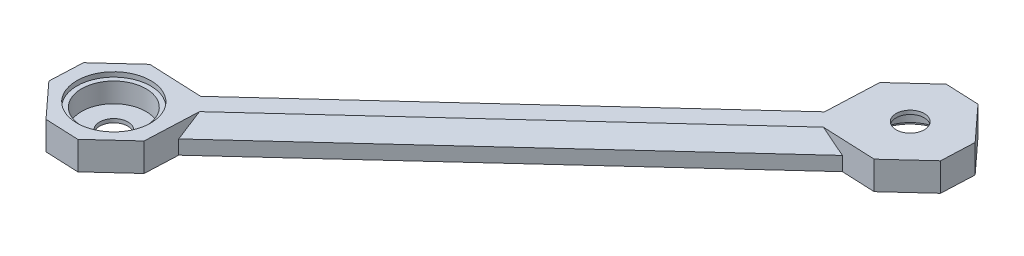
ISO-10303-21;
HEADER;
FILE_DESCRIPTION(('STEP AP214'),'2;1');
FILE_NAME('part.step','',(''),(''),'','','');
FILE_SCHEMA(('AUTOMOTIVE_DESIGN { 1 0 10303 214 1 1 1 1 }'));
ENDSEC;
DATA;
#1=APPLICATION_CONTEXT('core data for automotive mechanical design processes');
#2=APPLICATION_PROTOCOL_DEFINITION('international standard','automotive_design',2000,#1);
#3=PRODUCT_CONTEXT('',#1,'mechanical');
#4=PRODUCT('Part','Part','',(#3));
#5=PRODUCT_RELATED_PRODUCT_CATEGORY('part','',(#4));
#6=PRODUCT_DEFINITION_FORMATION('','',#4);
#7=PRODUCT_DEFINITION_CONTEXT('part definition',#1,'design');
#8=PRODUCT_DEFINITION('design','',#6,#7);
#9=PRODUCT_DEFINITION_SHAPE('','',#8);
#10=(LENGTH_UNIT() NAMED_UNIT(*) SI_UNIT(.MILLI.,.METRE.));
#11=(NAMED_UNIT(*) PLANE_ANGLE_UNIT() SI_UNIT($,.RADIAN.));
#12=(NAMED_UNIT(*) SI_UNIT($,.STERADIAN.) SOLID_ANGLE_UNIT());
#13=UNCERTAINTY_MEASURE_WITH_UNIT(LENGTH_MEASURE(1.E-05),#10,'distance_accuracy_value','');
#14=(GEOMETRIC_REPRESENTATION_CONTEXT(3) GLOBAL_UNCERTAINTY_ASSIGNED_CONTEXT((#13)) GLOBAL_UNIT_ASSIGNED_CONTEXT((#10,
#11,#12)) REPRESENTATION_CONTEXT('',''));
#15=CARTESIAN_POINT('',(0.,0.,0.));
#16=DIRECTION('',(0.,0.,1.));
#17=DIRECTION('',(1.,0.,0.));
#18=AXIS2_PLACEMENT_3D('',#15,#16,#17);
#19=CARTESIAN_POINT('',(64.048276533,-42.300004703,44.965154128));
#20=DIRECTION('',(0.,-1.,0.));
#21=DIRECTION('',(0.207911690937987,0.,-0.97814760070825));
#22=AXIS2_PLACEMENT_3D('',#19,#20,#21);
#23=CYLINDRICAL_SURFACE('',#22,3.);
#24=DIRECTION('',(0.,1.,0.));
#25=VECTOR('',#24,1.);
#26=CARTESIAN_POINT('',(64.672011605,-44.300004703,42.030711326));
#27=LINE('',#26,#25);
#28=CARTESIAN_POINT('',(64.672011605,-44.300004703,42.030711326));
#29=VERTEX_POINT('',#28);
#30=CARTESIAN_POINT('',(64.672011605,-43.500004703,42.030711326));
#31=VERTEX_POINT('',#30);
#32=EDGE_CURVE('E11',#29,#31,#27,.T.);
#33=ORIENTED_EDGE('',*,*,#32,.F.);
#34=CARTESIAN_POINT('',(64.048276533,-44.300004703,44.965154128));
#35=DIRECTION('',(0.,1.,0.));
#36=DIRECTION('',(-0.207911690937987,0.,0.97814760070825));
#37=AXIS2_PLACEMENT_3D('',#34,#35,#36);
#38=CIRCLE('',#37,3.);
#39=CARTESIAN_POINT('',(63.42454146,-44.300004703,47.89959693));
#40=VERTEX_POINT('',#39);
#41=EDGE_CURVE('E56',#40,#29,#38,.T.);
#42=ORIENTED_EDGE('',*,*,#41,.F.);
#43=CARTESIAN_POINT('',(64.048276533,-44.300004703,44.965154128));
#44=DIRECTION('',(0.,1.,0.));
#45=DIRECTION('',(-0.207911690937987,0.,0.97814760070825));
#46=AXIS2_PLACEMENT_3D('',#43,#44,#45);
#47=CIRCLE('',#46,3.);
#48=EDGE_CURVE('E242',#29,#40,#47,.T.);
#49=ORIENTED_EDGE('',*,*,#48,.F.);
#50=ORIENTED_EDGE('',*,*,#32,.T.);
#51=CARTESIAN_POINT('',(64.048276533,-43.500004703,44.965154128));
#52=DIRECTION('',(0.,1.,0.));
#53=DIRECTION('',(-0.207911690937987,0.,0.97814760070825));
#54=AXIS2_PLACEMENT_3D('',#51,#52,#53);
#55=CIRCLE('',#54,3.);
#56=CARTESIAN_POINT('',(63.42454146,-43.500004703,47.89959693));
#57=VERTEX_POINT('',#56);
#58=EDGE_CURVE('E48',#31,#57,#55,.T.);
#59=ORIENTED_EDGE('',*,*,#58,.T.);
#60=CARTESIAN_POINT('',(64.048276533,-43.500004703,44.965154128));
#61=DIRECTION('',(0.,1.,0.));
#62=DIRECTION('',(-0.207911690937987,0.,0.97814760070825));
#63=AXIS2_PLACEMENT_3D('',#60,#61,#62);
#64=CIRCLE('',#63,3.);
#65=EDGE_CURVE('E272',#57,#31,#64,.T.);
#66=ORIENTED_EDGE('',*,*,#65,.T.);
#67=EDGE_LOOP('',(#33,#42,#49,#50,#59,#66));
#68=FACE_BOUND('',#67,.T.);
#69=ADVANCED_FACE('F38',(#68),#23,.F.);
#70=CARTESIAN_POINT('',(348.939297813,-43.500004703,3.286550576));
#71=DIRECTION('',(0.,1.,0.));
#72=DIRECTION('',(1.,0.,0.));
#73=AXIS2_PLACEMENT_3D('',#70,#71,#72);
#74=PLANE('',#73);
#75=ORIENTED_EDGE('',*,*,#58,.F.);
#76=ORIENTED_EDGE('',*,*,#65,.F.);
#77=EDGE_LOOP('',(#75,#76));
#78=FACE_BOUND('',#77,.T.);
#79=DIRECTION('',(-0.043074595994265,0.,0.999071858866984));
#80=VECTOR('',#79,1.);
#81=CARTESIAN_POINT('',(53.603810934,-43.500004703,40.976026611));
#82=LINE('',#81,#80);
#83=CARTESIAN_POINT('',(53.603810934,-43.500004703,40.976026611));
#84=VERTEX_POINT('',#83);
#85=CARTESIAN_POINT('',(53.116477508,-43.500004703,52.279234391));
#86=VERTEX_POINT('',#85);
#87=EDGE_CURVE('E224',#84,#86,#82,.T.);
#88=ORIENTED_EDGE('',*,*,#87,.T.);
#89=DIRECTION('',(-0.736908825306351,0.,0.675992147281027));
#90=VECTOR('',#89,1.);
#91=CARTESIAN_POINT('',(53.116477508,-43.500004703,52.279234391));
#92=LINE('',#91,#90);
#93=CARTESIAN_POINT('',(-16.152952076,-43.500004703,115.82249623));
#94=VERTEX_POINT('',#93);
#95=EDGE_CURVE('E216',#86,#94,#92,.T.);
#96=ORIENTED_EDGE('',*,*,#95,.T.);
#97=DIRECTION('',(-0.999071858866984,0.,-0.043074595994265));
#98=VECTOR('',#97,1.);
#99=CARTESIAN_POINT('',(-16.152952076,-43.500004703,115.82249623));
#100=LINE('',#99,#98);
#101=CARTESIAN_POINT('',(-27.456159857,-43.500004703,115.335162804));
#102=VERTEX_POINT('',#101);
#103=EDGE_CURVE('E207',#94,#102,#100,.T.);
#104=ORIENTED_EDGE('',*,*,#103,.T.);
#105=DIRECTION('',(0.736908825306351,0.,-0.675992147281027));
#106=VECTOR('',#105,1.);
#107=CARTESIAN_POINT('',(-34.82524811,-43.500004703,122.095084277));
#108=LINE('',#107,#106);
#109=CARTESIAN_POINT('',(-34.82524811,-43.500004703,122.095084277));
#110=VERTEX_POINT('',#109);
#111=EDGE_CURVE('E361',#110,#102,#108,.T.);
#112=ORIENTED_EDGE('',*,*,#111,.F.);
#113=DIRECTION('',(-0.0430745959942651,0.,0.999071858866984));
#114=VECTOR('',#113,1.);
#115=CARTESIAN_POINT('',(-34.82524811,-43.500004703,122.095084277));
#116=LINE('',#115,#114);
#117=CARTESIAN_POINT('',(-35.129831501,-43.500004703,129.159589139));
#118=VERTEX_POINT('',#117);
#119=EDGE_CURVE('E217',#110,#118,#116,.T.);
#120=ORIENTED_EDGE('',*,*,#119,.T.);
#121=DIRECTION('',(-0.675992147281027,0.,-0.736908825306351));
#122=VECTOR('',#121,1.);
#123=CARTESIAN_POINT('',(-28.369910029,-43.500004703,136.528677393));
#124=LINE('',#123,#122);
#125=CARTESIAN_POINT('',(-28.369910029,-43.500004703,136.528677393));
#126=VERTEX_POINT('',#125);
#127=EDGE_CURVE('E248',#126,#118,#124,.T.);
#128=ORIENTED_EDGE('',*,*,#127,.F.);
#129=DIRECTION('',(0.999071858866984,0.,0.0430745959942651));
#130=VECTOR('',#129,1.);
#131=CARTESIAN_POINT('',(-28.369910029,-43.500004703,136.528677393));
#132=LINE('',#131,#130);
#133=CARTESIAN_POINT('',(-21.305405166,-43.500004703,136.833260784));
#134=VERTEX_POINT('',#133);
#135=EDGE_CURVE('E342',#126,#134,#132,.T.);
#136=ORIENTED_EDGE('',*,*,#135,.T.);
#137=DIRECTION('',(0.736908825306351,0.,-0.675992147281027));
#138=VECTOR('',#137,1.);
#139=CARTESIAN_POINT('',(-21.305405166,-43.500004703,136.833260784));
#140=LINE('',#139,#138);
#141=CARTESIAN_POINT('',(-13.936316912,-43.500004703,130.073339312));
#142=VERTEX_POINT('',#141);
#143=EDGE_CURVE('E265',#134,#142,#140,.T.);
#144=ORIENTED_EDGE('',*,*,#143,.T.);
#145=DIRECTION('',(-0.043074595994265,0.,0.999071858866984));
#146=VECTOR('',#145,1.);
#147=CARTESIAN_POINT('',(-13.448983487,-43.500004703,118.770131531));
#148=LINE('',#147,#146);
#149=CARTESIAN_POINT('',(-13.448983487,-43.500004703,118.770131531));
#150=VERTEX_POINT('',#149);
#151=EDGE_CURVE('E273',#150,#142,#148,.T.);
#152=ORIENTED_EDGE('',*,*,#151,.F.);
#153=DIRECTION('',(0.736908825306351,0.,-0.675992147281027));
#154=VECTOR('',#153,1.);
#155=CARTESIAN_POINT('',(-13.448983487,-43.500004703,118.770131531));
#156=LINE('',#155,#154);
#157=CARTESIAN_POINT('',(55.820446097,-43.500004703,55.226869693));
#158=VERTEX_POINT('',#157);
#159=EDGE_CURVE('E262',#150,#158,#156,.T.);
#160=ORIENTED_EDGE('',*,*,#159,.T.);
#161=DIRECTION('',(-0.999071858866984,0.,-0.043074595994265));
#162=VECTOR('',#161,1.);
#163=CARTESIAN_POINT('',(67.123653878,-43.500004703,55.714203118));
#164=LINE('',#163,#162);
#165=CARTESIAN_POINT('',(67.123653878,-43.500004703,55.714203118));
#166=VERTEX_POINT('',#165);
#167=EDGE_CURVE('E255',#166,#158,#164,.T.);
#168=ORIENTED_EDGE('',*,*,#167,.F.);
#169=DIRECTION('',(-0.736908825306351,0.,0.675992147281027));
#170=VECTOR('',#169,1.);
#171=CARTESIAN_POINT('',(74.492742132,-43.500004703,48.954281646));
#172=LINE('',#171,#170);
#173=CARTESIAN_POINT('',(74.492742132,-43.500004703,48.954281646));
#174=VERTEX_POINT('',#173);
#175=EDGE_CURVE('E184',#174,#166,#172,.T.);
#176=ORIENTED_EDGE('',*,*,#175,.F.);
#177=DIRECTION('',(-0.0430745959942651,0.,0.999071858866984));
#178=VECTOR('',#177,1.);
#179=CARTESIAN_POINT('',(74.797325522,-43.500004703,41.889776783));
#180=LINE('',#179,#178);
#181=CARTESIAN_POINT('',(74.797325522,-43.500004703,41.889776783));
#182=VERTEX_POINT('',#181);
#183=EDGE_CURVE('E189',#182,#174,#180,.T.);
#184=ORIENTED_EDGE('',*,*,#183,.F.);
#185=DIRECTION('',(0.675992147281027,0.,0.736908825306351));
#186=VECTOR('',#185,1.);
#187=CARTESIAN_POINT('',(68.03740405,-43.500004703,34.520688529));
#188=LINE('',#187,#186);
#189=CARTESIAN_POINT('',(68.03740405,-43.500004703,34.520688529));
#190=VERTEX_POINT('',#189);
#191=EDGE_CURVE('E291',#190,#182,#188,.T.);
#192=ORIENTED_EDGE('',*,*,#191,.F.);
#193=DIRECTION('',(-0.999071858866984,0.,-0.0430745959942651));
#194=VECTOR('',#193,1.);
#195=CARTESIAN_POINT('',(68.03740405,-43.500004703,34.520688529));
#196=LINE('',#195,#194);
#197=CARTESIAN_POINT('',(60.972899187,-43.500004703,34.216105138));
#198=VERTEX_POINT('',#197);
#199=EDGE_CURVE('E266',#190,#198,#196,.T.);
#200=ORIENTED_EDGE('',*,*,#199,.T.);
#201=DIRECTION('',(0.736908825306351,0.,-0.675992147281027));
#202=VECTOR('',#201,1.);
#203=CARTESIAN_POINT('',(53.603810934,-43.500004703,40.976026611));
#204=LINE('',#203,#202);
#205=EDGE_CURVE('E332',#84,#198,#204,.T.);
#206=ORIENTED_EDGE('',*,*,#205,.F.);
#207=EDGE_LOOP('',(#88,#96,#104,#112,#120,#128,#136,#144,#152,#160,#168,#176,#184,#192,#200,#206));
#208=FACE_BOUND('',#207,.T.);
#209=CARTESIAN_POINT('',(-24.380782511,-43.500004703,126.084211794));
#210=DIRECTION('',(0.,1.,0.));
#211=DIRECTION('',(-1.,0.,0.));
#212=AXIS2_PLACEMENT_3D('',#209,#210,#211);
#213=CIRCLE('',#212,7.85);
#214=CARTESIAN_POINT('',(-22.748675738,-43.500004703,118.405753128));
#215=VERTEX_POINT('',#214);
#216=CARTESIAN_POINT('',(-32.230782511,-43.500004703,126.084211794));
#217=VERTEX_POINT('',#216);
#218=EDGE_CURVE('E261',#215,#217,#213,.T.);
#219=ORIENTED_EDGE('',*,*,#218,.F.);
#220=CARTESIAN_POINT('',(-24.380782511,-43.500004703,126.084211794));
#221=DIRECTION('',(0.,1.,0.));
#222=DIRECTION('',(-1.,0.,0.));
#223=AXIS2_PLACEMENT_3D('',#220,#221,#222);
#224=CIRCLE('',#223,7.85);
#225=EDGE_CURVE('E308',#217,#215,#224,.T.);
#226=ORIENTED_EDGE('',*,*,#225,.F.);
#227=EDGE_LOOP('',(#219,#226));
#228=FACE_BOUND('',#227,.T.);
#229=ADVANCED_FACE('F220',(#78,#208,#228),#74,.T.);
#230=CARTESIAN_POINT('',(348.939297813,-44.300004703,3.286550576));
#231=DIRECTION('',(0.,1.,0.));
#232=DIRECTION('',(1.,0.,0.));
#233=AXIS2_PLACEMENT_3D('',#230,#231,#232);
#234=PLANE('',#233);
#235=CARTESIAN_POINT('',(64.048276533,-44.300004703,44.965154128));
#236=DIRECTION('',(0.,1.,0.));
#237=DIRECTION('',(-1.,0.,0.));
#238=AXIS2_PLACEMENT_3D('',#235,#236,#237);
#239=CIRCLE('',#238,6.85);
#240=CARTESIAN_POINT('',(57.198276533,-44.300004703,44.965154128));
#241=VERTEX_POINT('',#240);
#242=EDGE_CURVE('E244',#241,#241,#239,.T.);
#243=ORIENTED_EDGE('',*,*,#242,.F.);
#244=EDGE_LOOP('',(#243));
#245=FACE_BOUND('',#244,.T.);
#246=ORIENTED_EDGE('',*,*,#41,.T.);
#247=ORIENTED_EDGE('',*,*,#48,.T.);
#248=EDGE_LOOP('',(#246,#247));
#249=FACE_BOUND('',#248,.T.);
#250=ADVANCED_FACE('F534',(#245,#249),#234,.F.);
#251=CARTESIAN_POINT('',(64.048276533,-48.500004703,44.965154128));
#252=DIRECTION('',(0.,1.,0.));
#253=DIRECTION('',(-1.,0.,0.));
#254=AXIS2_PLACEMENT_3D('',#251,#252,#253);
#255=CYLINDRICAL_SURFACE('',#254,6.85);
#256=DIRECTION('',(0.,-1.,0.));
#257=VECTOR('',#256,1.);
#258=CARTESIAN_POINT('',(57.198276533,-44.300004703,44.965154128));
#259=LINE('',#258,#257);
#260=CARTESIAN_POINT('',(57.198276533,-48.500004703,44.965154128));
#261=VERTEX_POINT('',#260);
#262=EDGE_CURVE('E288',#241,#261,#259,.T.);
#263=ORIENTED_EDGE('',*,*,#262,.F.);
#264=ORIENTED_EDGE('',*,*,#242,.T.);
#265=ORIENTED_EDGE('',*,*,#262,.T.);
#266=CARTESIAN_POINT('',(64.048276533,-48.500004703,44.965154128));
#267=DIRECTION('',(0.,-1.,0.));
#268=DIRECTION('',(0.,0.,-1.));
#269=AXIS2_PLACEMENT_3D('',#266,#267,#268);
#270=CIRCLE('',#269,6.85);
#271=CARTESIAN_POINT('',(64.048276533,-48.500004703,38.115154128));
#272=VERTEX_POINT('',#271);
#273=EDGE_CURVE('E387',#261,#272,#270,.T.);
#274=ORIENTED_EDGE('',*,*,#273,.T.);
#275=CARTESIAN_POINT('',(64.048276533,-48.500004703,44.965154128));
#276=DIRECTION('',(0.,-1.,0.));
#277=DIRECTION('',(0.,0.,-1.));
#278=AXIS2_PLACEMENT_3D('',#275,#276,#277);
#279=CIRCLE('',#278,6.85);
#280=EDGE_CURVE('E317',#272,#261,#279,.T.);
#281=ORIENTED_EDGE('',*,*,#280,.T.);
#282=EDGE_LOOP('',(#263,#264,#265,#274,#281));
#283=FACE_BOUND('',#282,.T.);
#284=ADVANCED_FACE('F551',(#283),#255,.F.);
#285=CARTESIAN_POINT('',(-35.951723467,-48.500004703,314.965154128));
#286=DIRECTION('',(0.,-1.,0.));
#287=DIRECTION('',(0.,0.,-1.));
#288=AXIS2_PLACEMENT_3D('',#285,#286,#287);
#289=PLANE('',#288);
#290=ORIENTED_EDGE('',*,*,#273,.F.);
#291=ORIENTED_EDGE('',*,*,#280,.F.);
#292=EDGE_LOOP('',(#290,#291));
#293=FACE_BOUND('',#292,.T.);
#294=CARTESIAN_POINT('',(64.048276533,-48.500004703,44.965154128));
#295=DIRECTION('',(0.,1.,0.));
#296=DIRECTION('',(0.,0.,-1.));
#297=AXIS2_PLACEMENT_3D('',#294,#295,#296);
#298=CIRCLE('',#297,7.85);
#299=CARTESIAN_POINT('',(65.680383306,-48.500004703,37.286695462));
#300=VERTEX_POINT('',#299);
#301=CARTESIAN_POINT('',(64.048276533,-48.500004703,37.115154128));
#302=VERTEX_POINT('',#301);
#303=EDGE_CURVE('E281',#300,#302,#298,.T.);
#304=ORIENTED_EDGE('',*,*,#303,.F.);
#305=CARTESIAN_POINT('',(64.048276533,-48.500004703,44.965154128));
#306=DIRECTION('',(0.,1.,0.));
#307=DIRECTION('',(0.,0.,-1.));
#308=AXIS2_PLACEMENT_3D('',#305,#306,#307);
#309=CIRCLE('',#308,7.85);
#310=EDGE_CURVE('E285',#302,#300,#309,.T.);
#311=ORIENTED_EDGE('',*,*,#310,.F.);
#312=EDGE_LOOP('',(#304,#311));
#313=FACE_BOUND('',#312,.T.);
#314=ADVANCED_FACE('F559',(#293,#313),#289,.T.);
#315=CARTESIAN_POINT('',(88.5373879,-43.500004703,25.214478773));
#316=DIRECTION('',(0.477998631020937,0.707106781030973,0.521073228022824));
#317=DIRECTION('',(0.736908825897274,0.,-0.675992146636853));
#318=AXIS2_PLACEMENT_3D('',#315,#316,#317);
#319=PLANE('',#318);
#320=DIRECTION('',(0.0351702609992071,0.577350268986985,-0.815738756981611));
#321=VECTOR('',#320,1.);
#322=CARTESIAN_POINT('',(-13.631733522,-46.500004703,123.008834449));
#323=LINE('',#322,#321);
#324=CARTESIAN_POINT('',(-13.631733522,-46.500004703,123.008834449));
#325=VERTEX_POINT('',#324);
#326=EDGE_CURVE('E274',#325,#150,#323,.T.);
#327=ORIENTED_EDGE('',*,*,#326,.F.);
#328=DIRECTION('',(-0.736908825306351,0.,0.675992147281027));
#329=VECTOR('',#328,1.);
#330=CARTESIAN_POINT('',(60.059149015,-46.500004703,55.409619727));
#331=LINE('',#330,#329);
#332=CARTESIAN_POINT('',(60.059149015,-46.500004703,55.409619727));
#333=VERTEX_POINT('',#332);
#334=EDGE_CURVE('E323',#333,#325,#331,.T.);
#335=ORIENTED_EDGE('',*,*,#334,.F.);
#336=DIRECTION('',(0.815738756981611,-0.577350268986985,0.0351702609992071));
#337=VECTOR('',#336,1.);
#338=CARTESIAN_POINT('',(55.820446097,-43.500004703,55.226869693));
#339=LINE('',#338,#337);
#340=EDGE_CURVE('E252',#158,#333,#339,.T.);
#341=ORIENTED_EDGE('',*,*,#340,.F.);
#342=ORIENTED_EDGE('',*,*,#159,.F.);
#343=EDGE_LOOP('',(#327,#335,#341,#342));
#344=FACE_BOUND('',#343,.T.);
#345=ADVANCED_FACE('F512',(#344),#319,.T.);
#346=CARTESIAN_POINT('',(16.453786275,-46.500004703,81.840138834));
#347=DIRECTION('',(0.477998631020937,-0.707106781030973,0.521073228022824));
#348=DIRECTION('',(-0.828467323191241,-0.560037404468969,0.));
#349=AXIS2_PLACEMENT_3D('',#346,#347,#348);
#350=PLANE('',#349);
#351=DIRECTION('',(-0.815738756981611,-0.577350268986985,-0.0351702609992071));
#352=VECTOR('',#351,1.);
#353=CARTESIAN_POINT('',(-16.152952076,-43.500004703,115.82249623));
#354=LINE('',#353,#352);
#355=CARTESIAN_POINT('',(-20.391654994,-46.500004703,115.639746195));
#356=VERTEX_POINT('',#355);
#357=EDGE_CURVE('E212',#94,#356,#354,.T.);
#358=ORIENTED_EDGE('',*,*,#357,.F.);
#359=ORIENTED_EDGE('',*,*,#95,.F.);
#360=DIRECTION('',(-0.0351702609992071,0.577350268986985,0.815738756981611));
#361=VECTOR('',#360,1.);
#362=CARTESIAN_POINT('',(53.299227543,-46.500004703,48.040531474));
#363=LINE('',#362,#361);
#364=CARTESIAN_POINT('',(53.299227543,-46.500004703,48.040531474));
#365=VERTEX_POINT('',#364);
#366=EDGE_CURVE('E399',#365,#86,#363,.T.);
#367=ORIENTED_EDGE('',*,*,#366,.F.);
#368=DIRECTION('',(0.736908825306351,0.,-0.675992147281027));
#369=VECTOR('',#368,1.);
#370=CARTESIAN_POINT('',(-20.391654994,-46.500004703,115.639746195));
#371=LINE('',#370,#369);
#372=EDGE_CURVE('E232',#356,#365,#371,.T.);
#373=ORIENTED_EDGE('',*,*,#372,.F.);
#374=EDGE_LOOP('',(#358,#359,#367,#373));
#375=FACE_BOUND('',#374,.T.);
#376=ADVANCED_FACE('F230',(#375),#350,.F.);
#377=CARTESIAN_POINT('',(64.048276533,-43.500004703,44.965154128));
#378=DIRECTION('',(0.,-1.,0.));
#379=DIRECTION('',(0.207911690937987,0.,-0.97814760070825));
#380=AXIS2_PLACEMENT_3D('',#377,#378,#379);
#381=CYLINDRICAL_SURFACE('',#380,7.85);
#382=DIRECTION('',(0.,1.,0.));
#383=VECTOR('',#382,1.);
#384=CARTESIAN_POINT('',(65.680383306,-49.500004703,37.286695462));
#385=LINE('',#384,#383);
#386=CARTESIAN_POINT('',(65.680383306,-49.500004703,37.286695462));
#387=VERTEX_POINT('',#386);
#388=EDGE_CURVE('E284',#387,#300,#385,.T.);
#389=ORIENTED_EDGE('',*,*,#388,.F.);
#390=CARTESIAN_POINT('',(64.048276533,-49.500004703,44.965154128));
#391=DIRECTION('',(0.,1.,0.));
#392=DIRECTION('',(-1.,0.,0.));
#393=AXIS2_PLACEMENT_3D('',#390,#391,#392);
#394=CIRCLE('',#393,7.85);
#395=CARTESIAN_POINT('',(56.198276533,-49.500004703,44.965154128));
#396=VERTEX_POINT('',#395);
#397=EDGE_CURVE('E305',#396,#387,#394,.T.);
#398=ORIENTED_EDGE('',*,*,#397,.F.);
#399=CARTESIAN_POINT('',(64.048276533,-49.500004703,44.965154128));
#400=DIRECTION('',(0.,1.,0.));
#401=DIRECTION('',(-1.,0.,0.));
#402=AXIS2_PLACEMENT_3D('',#399,#400,#401);
#403=CIRCLE('',#402,7.85);
#404=EDGE_CURVE('E302',#387,#396,#403,.T.);
#405=ORIENTED_EDGE('',*,*,#404,.F.);
#406=ORIENTED_EDGE('',*,*,#388,.T.);
#407=ORIENTED_EDGE('',*,*,#303,.T.);
#408=ORIENTED_EDGE('',*,*,#310,.T.);
#409=EDGE_LOOP('',(#389,#398,#405,#406,#407,#408));
#410=FACE_BOUND('',#409,.T.);
#411=ADVANCED_FACE('F518',(#410),#381,.F.);
#412=CARTESIAN_POINT('',(-34.977539806,-43.500004703,125.627336708));
#413=DIRECTION('',(0.999071858866984,0.,0.043074595994265));
#414=DIRECTION('',(0.,-1.,0.));
#415=AXIS2_PLACEMENT_3D('',#412,#413,#414);
#416=PLANE('',#415);
#417=DIRECTION('',(-0.0430745959942651,0.,0.999071858866984));
#418=VECTOR('',#417,1.);
#419=CARTESIAN_POINT('',(-34.82524811,-49.500004703,122.095084277));
#420=LINE('',#419,#418);
#421=CARTESIAN_POINT('',(-34.82524811,-49.500004703,122.095084277));
#422=VERTEX_POINT('',#421);
#423=CARTESIAN_POINT('',(-35.129831501,-49.500004703,129.159589139));
#424=VERTEX_POINT('',#423);
#425=EDGE_CURVE('E310',#422,#424,#420,.T.);
#426=ORIENTED_EDGE('',*,*,#425,.T.);
#427=DIRECTION('',(0.,-1.,0.));
#428=VECTOR('',#427,1.);
#429=CARTESIAN_POINT('',(-35.129831501,-43.500004703,129.159589139));
#430=LINE('',#429,#428);
#431=EDGE_CURVE('E251',#118,#424,#430,.T.);
#432=ORIENTED_EDGE('',*,*,#431,.F.);
#433=ORIENTED_EDGE('',*,*,#119,.F.);
#434=DIRECTION('',(0.,-1.,0.));
#435=VECTOR('',#434,1.);
#436=CARTESIAN_POINT('',(-34.82524811,-43.500004703,122.095084277));
#437=LINE('',#436,#435);
#438=EDGE_CURVE('E270',#110,#422,#437,.T.);
#439=ORIENTED_EDGE('',*,*,#438,.T.);
#440=EDGE_LOOP('',(#426,#432,#433,#439));
#441=FACE_BOUND('',#440,.T.);
#442=ADVANCED_FACE('F515',(#441),#416,.F.);
#443=CARTESIAN_POINT('',(-24.380782511,-43.500004703,126.084211794));
#444=DIRECTION('',(0.,-1.,0.));
#445=DIRECTION('',(0.207911690937987,0.,-0.97814760070825));
#446=AXIS2_PLACEMENT_3D('',#443,#444,#445);
#447=CYLINDRICAL_SURFACE('',#446,7.85);
#448=DIRECTION('',(0.,1.,0.));
#449=VECTOR('',#448,1.);
#450=CARTESIAN_POINT('',(-22.748675738,-44.500004703,118.405753128));
#451=LINE('',#450,#449);
#452=CARTESIAN_POINT('',(-22.748675738,-44.500004703,118.405753128));
#453=VERTEX_POINT('',#452);
#454=EDGE_CURVE('E257',#453,#215,#451,.T.);
#455=ORIENTED_EDGE('',*,*,#454,.F.);
#456=CARTESIAN_POINT('',(-24.380782511,-44.500004703,126.084211794));
#457=DIRECTION('',(0.,-1.,0.));
#458=DIRECTION('',(-1.,0.,0.));
#459=AXIS2_PLACEMENT_3D('',#456,#457,#458);
#460=CIRCLE('',#459,7.85);
#461=CARTESIAN_POINT('',(-32.230782511,-44.500004703,126.084211794));
#462=VERTEX_POINT('',#461);
#463=EDGE_CURVE('E267',#453,#462,#460,.T.);
#464=ORIENTED_EDGE('',*,*,#463,.T.);
#465=CARTESIAN_POINT('',(-24.380782511,-44.500004703,126.084211794));
#466=DIRECTION('',(0.,-1.,0.));
#467=DIRECTION('',(-1.,0.,0.));
#468=AXIS2_PLACEMENT_3D('',#465,#466,#467);
#469=CIRCLE('',#468,7.85);
#470=EDGE_CURVE('E260',#462,#453,#469,.T.);
#471=ORIENTED_EDGE('',*,*,#470,.T.);
#472=ORIENTED_EDGE('',*,*,#454,.T.);
#473=ORIENTED_EDGE('',*,*,#218,.T.);
#474=ORIENTED_EDGE('',*,*,#225,.T.);
#475=EDGE_LOOP('',(#455,#464,#471,#472,#473,#474));
#476=FACE_BOUND('',#475,.T.);
#477=ADVANCED_FACE('F517',(#476),#447,.F.);
#478=CARTESIAN_POINT('',(5.135598585,-43.500004703,85.437606944));
#479=DIRECTION('',(-0.675992147281027,0.,-0.736908825306351));
#480=DIRECTION('',(-0.736908825306351,0.,0.675992147281027));
#481=AXIS2_PLACEMENT_3D('',#478,#479,#480);
#482=PLANE('',#481);
#483=DIRECTION('',(0.736908825306351,0.,-0.675992147281027));
#484=VECTOR('',#483,1.);
#485=CARTESIAN_POINT('',(-34.82524811,-49.500004703,122.095084277));
#486=LINE('',#485,#484);
#487=CARTESIAN_POINT('',(-27.456159857,-49.500004703,115.335162804));
#488=VERTEX_POINT('',#487);
#489=EDGE_CURVE('E395',#422,#488,#486,.T.);
#490=ORIENTED_EDGE('',*,*,#489,.F.);
#491=ORIENTED_EDGE('',*,*,#438,.F.);
#492=ORIENTED_EDGE('',*,*,#111,.T.);
#493=DIRECTION('',(0.,-1.,0.));
#494=VECTOR('',#493,1.);
#495=CARTESIAN_POINT('',(-27.456159857,-43.500004703,115.335162804));
#496=LINE('',#495,#494);
#497=EDGE_CURVE('E215',#102,#488,#496,.T.);
#498=ORIENTED_EDGE('',*,*,#497,.T.);
#499=EDGE_LOOP('',(#490,#491,#492,#498));
#500=FACE_BOUND('',#499,.T.);
#501=ADVANCED_FACE('F494',(#500),#482,.T.);
#502=CARTESIAN_POINT('',(-23.923907425,-43.500004703,115.4874545));
#503=DIRECTION('',(-0.043074595994265,0.,0.999071858866984));
#504=DIRECTION('',(0.,1.,0.));
#505=AXIS2_PLACEMENT_3D('',#502,#503,#504);
#506=PLANE('',#505);
#507=DIRECTION('',(-0.999071858866984,0.,-0.0430745959942651));
#508=VECTOR('',#507,1.);
#509=CARTESIAN_POINT('',(-20.391654994,-49.500004703,115.639746195));
#510=LINE('',#509,#508);
#511=CARTESIAN_POINT('',(-20.391654994,-49.500004703,115.639746195));
#512=VERTEX_POINT('',#511);
#513=EDGE_CURVE('E233',#512,#488,#510,.T.);
#514=ORIENTED_EDGE('',*,*,#513,.T.);
#515=ORIENTED_EDGE('',*,*,#497,.F.);
#516=ORIENTED_EDGE('',*,*,#103,.F.);
#517=ORIENTED_EDGE('',*,*,#357,.T.);
#518=DIRECTION('',(0.,-1.,0.));
#519=VECTOR('',#518,1.);
#520=CARTESIAN_POINT('',(-20.391654994,-46.500004703,115.639746195));
#521=LINE('',#520,#519);
#522=EDGE_CURVE('E234',#356,#512,#521,.T.);
#523=ORIENTED_EDGE('',*,*,#522,.T.);
#524=EDGE_LOOP('',(#514,#515,#516,#517,#523));
#525=FACE_BOUND('',#524,.T.);
#526=ADVANCED_FACE('F210',(#525),#506,.F.);
#527=CARTESIAN_POINT('',(16.453786275,-43.500004703,81.840138834));
#528=DIRECTION('',(-0.675992147281027,0.,-0.736908825306351));
#529=DIRECTION('',(-0.736908825306351,0.,0.675992147281027));
#530=AXIS2_PLACEMENT_3D('',#527,#528,#529);
#531=PLANE('',#530);
#532=ORIENTED_EDGE('',*,*,#522,.F.);
#533=ORIENTED_EDGE('',*,*,#372,.T.);
#534=DIRECTION('',(0.,-1.,0.));
#535=VECTOR('',#534,1.);
#536=CARTESIAN_POINT('',(53.299227543,-46.500004703,48.040531474));
#537=LINE('',#536,#535);
#538=CARTESIAN_POINT('',(53.299227543,-49.500004703,48.040531474));
#539=VERTEX_POINT('',#538);
#540=EDGE_CURVE('E327',#365,#539,#537,.T.);
#541=ORIENTED_EDGE('',*,*,#540,.T.);
#542=DIRECTION('',(0.736908825306351,0.,-0.675992147281027));
#543=VECTOR('',#542,1.);
#544=CARTESIAN_POINT('',(-20.391654994,-49.500004703,115.639746195));
#545=LINE('',#544,#543);
#546=EDGE_CURVE('E42',#512,#539,#545,.T.);
#547=ORIENTED_EDGE('',*,*,#546,.F.);
#548=EDGE_LOOP('',(#532,#533,#541,#547));
#549=FACE_BOUND('',#548,.T.);
#550=ADVANCED_FACE('F496',(#549),#531,.T.);
#551=CARTESIAN_POINT('',(53.451519238,-43.500004703,44.508279042));
#552=DIRECTION('',(0.999071858866984,0.,0.043074595994265));
#553=DIRECTION('',(0.,-1.,0.));
#554=AXIS2_PLACEMENT_3D('',#551,#552,#553);
#555=PLANE('',#554);
#556=DIRECTION('',(-0.0430745959942651,0.,0.999071858866984));
#557=VECTOR('',#556,1.);
#558=CARTESIAN_POINT('',(53.603810934,-49.500004703,40.976026611));
#559=LINE('',#558,#557);
#560=CARTESIAN_POINT('',(53.603810934,-49.500004703,40.976026611));
#561=VERTEX_POINT('',#560);
#562=EDGE_CURVE('E330',#561,#539,#559,.T.);
#563=ORIENTED_EDGE('',*,*,#562,.T.);
#564=ORIENTED_EDGE('',*,*,#540,.F.);
#565=ORIENTED_EDGE('',*,*,#366,.T.);
#566=ORIENTED_EDGE('',*,*,#87,.F.);
#567=DIRECTION('',(0.,-1.,0.));
#568=VECTOR('',#567,1.);
#569=CARTESIAN_POINT('',(53.603810934,-43.500004703,40.976026611));
#570=LINE('',#569,#568);
#571=EDGE_CURVE('E335',#84,#561,#570,.T.);
#572=ORIENTED_EDGE('',*,*,#571,.T.);
#573=EDGE_LOOP('',(#563,#564,#565,#566,#572));
#574=FACE_BOUND('',#573,.T.);
#575=ADVANCED_FACE('F436',(#574),#555,.F.);
#576=CARTESIAN_POINT('',(59.130627124,-43.500004703,35.906085507));
#577=DIRECTION('',(-0.675992147281027,0.,-0.736908825306351));
#578=DIRECTION('',(-0.736908825306351,0.,0.675992147281027));
#579=AXIS2_PLACEMENT_3D('',#576,#577,#578);
#580=PLANE('',#579);
#581=DIRECTION('',(0.736908825306351,0.,-0.675992147281027));
#582=VECTOR('',#581,1.);
#583=CARTESIAN_POINT('',(53.603810934,-49.500004703,40.976026611));
#584=LINE('',#583,#582);
#585=CARTESIAN_POINT('',(60.972899187,-49.500004703,34.216105138));
#586=VERTEX_POINT('',#585);
#587=EDGE_CURVE('E372',#561,#586,#584,.T.);
#588=ORIENTED_EDGE('',*,*,#587,.F.);
#589=ORIENTED_EDGE('',*,*,#571,.F.);
#590=ORIENTED_EDGE('',*,*,#205,.T.);
#591=DIRECTION('',(0.,-1.,0.));
#592=VECTOR('',#591,1.);
#593=CARTESIAN_POINT('',(60.972899187,-43.500004703,34.216105138));
#594=LINE('',#593,#592);
#595=EDGE_CURVE('E336',#198,#586,#594,.T.);
#596=ORIENTED_EDGE('',*,*,#595,.T.);
#597=EDGE_LOOP('',(#588,#589,#590,#596));
#598=FACE_BOUND('',#597,.T.);
#599=ADVANCED_FACE('F445',(#598),#580,.T.);
#600=CARTESIAN_POINT('',(64.505151619,-43.500004703,34.368396834));
#601=DIRECTION('',(-0.043074595994265,0.,0.999071858866984));
#602=DIRECTION('',(0.,1.,0.));
#603=AXIS2_PLACEMENT_3D('',#600,#601,#602);
#604=PLANE('',#603);
#605=DIRECTION('',(-0.999071858866984,0.,-0.0430745959942651));
#606=VECTOR('',#605,1.);
#607=CARTESIAN_POINT('',(68.03740405,-49.500004703,34.520688529));
#608=LINE('',#607,#606);
#609=CARTESIAN_POINT('',(68.03740405,-49.500004703,34.520688529));
#610=VERTEX_POINT('',#609);
#611=EDGE_CURVE('E363',#610,#586,#608,.T.);
#612=ORIENTED_EDGE('',*,*,#611,.T.);
#613=ORIENTED_EDGE('',*,*,#595,.F.);
#614=ORIENTED_EDGE('',*,*,#199,.F.);
#615=DIRECTION('',(0.,-1.,0.));
#616=VECTOR('',#615,1.);
#617=CARTESIAN_POINT('',(68.03740405,-43.500004703,34.520688529));
#618=LINE('',#617,#616);
#619=EDGE_CURVE('E293',#190,#610,#618,.T.);
#620=ORIENTED_EDGE('',*,*,#619,.T.);
#621=EDGE_LOOP('',(#612,#613,#614,#620));
#622=FACE_BOUND('',#621,.T.);
#623=ADVANCED_FACE('F450',(#622),#604,.F.);
#624=CARTESIAN_POINT('',(73.107345154,-43.500004703,40.047504719));
#625=DIRECTION('',(0.736908825306351,0.,-0.675992147281027));
#626=DIRECTION('',(0.,-1.,0.));
#627=AXIS2_PLACEMENT_3D('',#624,#625,#626);
#628=PLANE('',#627);
#629=DIRECTION('',(0.675992147281027,0.,0.736908825306351));
#630=VECTOR('',#629,1.);
#631=CARTESIAN_POINT('',(68.03740405,-49.500004703,34.520688529));
#632=LINE('',#631,#630);
#633=CARTESIAN_POINT('',(74.797325522,-49.500004703,41.889776783));
#634=VERTEX_POINT('',#633);
#635=EDGE_CURVE('E371',#610,#634,#632,.T.);
#636=ORIENTED_EDGE('',*,*,#635,.F.);
#637=ORIENTED_EDGE('',*,*,#619,.F.);
#638=ORIENTED_EDGE('',*,*,#191,.T.);
#639=DIRECTION('',(0.,-1.,0.));
#640=VECTOR('',#639,1.);
#641=CARTESIAN_POINT('',(74.797325522,-43.500004703,41.889776783));
#642=LINE('',#641,#640);
#643=EDGE_CURVE('E290',#182,#634,#642,.T.);
#644=ORIENTED_EDGE('',*,*,#643,.T.);
#645=EDGE_LOOP('',(#636,#637,#638,#644));
#646=FACE_BOUND('',#645,.T.);
#647=ADVANCED_FACE('F454',(#646),#628,.T.);
#648=CARTESIAN_POINT('',(74.645033827,-43.500004703,45.422029214));
#649=DIRECTION('',(0.999071858866984,0.,0.043074595994265));
#650=DIRECTION('',(0.,-1.,0.));
#651=AXIS2_PLACEMENT_3D('',#648,#649,#650);
#652=PLANE('',#651);
#653=DIRECTION('',(-0.0430745959942651,0.,0.999071858866984));
#654=VECTOR('',#653,1.);
#655=CARTESIAN_POINT('',(74.797325522,-49.500004703,41.889776783));
#656=LINE('',#655,#654);
#657=CARTESIAN_POINT('',(74.492742132,-49.500004703,48.954281646));
#658=VERTEX_POINT('',#657);
#659=EDGE_CURVE('E240',#634,#658,#656,.T.);
#660=ORIENTED_EDGE('',*,*,#659,.F.);
#661=ORIENTED_EDGE('',*,*,#643,.F.);
#662=ORIENTED_EDGE('',*,*,#183,.T.);
#663=DIRECTION('',(0.,-1.,0.));
#664=VECTOR('',#663,1.);
#665=CARTESIAN_POINT('',(74.492742132,-43.500004703,48.954281646));
#666=LINE('',#665,#664);
#667=EDGE_CURVE('E246',#174,#658,#666,.T.);
#668=ORIENTED_EDGE('',*,*,#667,.T.);
#669=EDGE_LOOP('',(#660,#661,#662,#668));
#670=FACE_BOUND('',#669,.T.);
#671=ADVANCED_FACE('F457',(#670),#652,.T.);
#672=CARTESIAN_POINT('',(68.965925941,-43.500004703,54.02422275));
#673=DIRECTION('',(0.675992147281027,0.,0.736908825306351));
#674=DIRECTION('',(0.,-1.,0.));
#675=AXIS2_PLACEMENT_3D('',#672,#673,#674);
#676=PLANE('',#675);
#677=DIRECTION('',(-0.736908825306351,0.,0.675992147281027));
#678=VECTOR('',#677,1.);
#679=CARTESIAN_POINT('',(74.492742132,-49.500004703,48.954281646));
#680=LINE('',#679,#678);
#681=CARTESIAN_POINT('',(67.123653878,-49.500004703,55.714203118));
#682=VERTEX_POINT('',#681);
#683=EDGE_CURVE('E355',#658,#682,#680,.T.);
#684=ORIENTED_EDGE('',*,*,#683,.F.);
#685=ORIENTED_EDGE('',*,*,#667,.F.);
#686=ORIENTED_EDGE('',*,*,#175,.T.);
#687=DIRECTION('',(0.,-1.,0.));
#688=VECTOR('',#687,1.);
#689=CARTESIAN_POINT('',(67.123653878,-43.500004703,55.714203118));
#690=LINE('',#689,#688);
#691=EDGE_CURVE('E247',#166,#682,#690,.T.);
#692=ORIENTED_EDGE('',*,*,#691,.T.);
#693=EDGE_LOOP('',(#684,#685,#686,#692));
#694=FACE_BOUND('',#693,.T.);
#695=ADVANCED_FACE('F460',(#694),#676,.T.);
#696=CARTESIAN_POINT('',(63.591401446,-43.500004703,55.561911423));
#697=DIRECTION('',(-0.043074595994265,0.,0.999071858866984));
#698=DIRECTION('',(0.,1.,0.));
#699=AXIS2_PLACEMENT_3D('',#696,#697,#698);
#700=PLANE('',#699);
#701=DIRECTION('',(-0.999071858866984,0.,-0.0430745959942651));
#702=VECTOR('',#701,1.);
#703=CARTESIAN_POINT('',(67.123653878,-49.500004703,55.714203118));
#704=LINE('',#703,#702);
#705=CARTESIAN_POINT('',(60.059149015,-49.500004703,55.409619727));
#706=VERTEX_POINT('',#705);
#707=EDGE_CURVE('E354',#682,#706,#704,.T.);
#708=ORIENTED_EDGE('',*,*,#707,.F.);
#709=ORIENTED_EDGE('',*,*,#691,.F.);
#710=ORIENTED_EDGE('',*,*,#167,.T.);
#711=ORIENTED_EDGE('',*,*,#340,.T.);
#712=DIRECTION('',(0.,-1.,0.));
#713=VECTOR('',#712,1.);
#714=CARTESIAN_POINT('',(60.059149015,-46.500004703,55.409619727));
#715=LINE('',#714,#713);
#716=EDGE_CURVE('E256',#333,#706,#715,.T.);
#717=ORIENTED_EDGE('',*,*,#716,.T.);
#718=EDGE_LOOP('',(#708,#709,#710,#711,#717));
#719=FACE_BOUND('',#718,.T.);
#720=ADVANCED_FACE('F464',(#719),#700,.T.);
#721=CARTESIAN_POINT('',(13.915930872,-43.500004703,97.738401848));
#722=DIRECTION('',(-0.675992147281027,0.,-0.736908825306351));
#723=DIRECTION('',(-0.736908825306351,0.,0.675992147281027));
#724=AXIS2_PLACEMENT_3D('',#721,#722,#723);
#725=PLANE('',#724);
#726=ORIENTED_EDGE('',*,*,#716,.F.);
#727=ORIENTED_EDGE('',*,*,#334,.T.);
#728=DIRECTION('',(0.,-1.,0.));
#729=VECTOR('',#728,1.);
#730=CARTESIAN_POINT('',(-13.631733522,-46.500004703,123.008834449));
#731=LINE('',#730,#729);
#732=CARTESIAN_POINT('',(-13.631733522,-49.500004703,123.008834449));
#733=VERTEX_POINT('',#732);
#734=EDGE_CURVE('E325',#325,#733,#731,.T.);
#735=ORIENTED_EDGE('',*,*,#734,.T.);
#736=DIRECTION('',(0.736908825306351,0.,-0.675992147281027));
#737=VECTOR('',#736,1.);
#738=CARTESIAN_POINT('',(-13.631733522,-49.500004703,123.008834449));
#739=LINE('',#738,#737);
#740=EDGE_CURVE('E353',#733,#706,#739,.T.);
#741=ORIENTED_EDGE('',*,*,#740,.T.);
#742=EDGE_LOOP('',(#726,#727,#735,#741));
#743=FACE_BOUND('',#742,.T.);
#744=ADVANCED_FACE('F472',(#743),#725,.F.);
#745=CARTESIAN_POINT('',(-13.784025217,-43.500004703,126.54108688));
#746=DIRECTION('',(0.999071858866984,0.,0.043074595994265));
#747=DIRECTION('',(0.,-1.,0.));
#748=AXIS2_PLACEMENT_3D('',#745,#746,#747);
#749=PLANE('',#748);
#750=DIRECTION('',(-0.0430745959942651,0.,0.999071858866984));
#751=VECTOR('',#750,1.);
#752=CARTESIAN_POINT('',(-13.631733522,-49.500004703,123.008834449));
#753=LINE('',#752,#751);
#754=CARTESIAN_POINT('',(-13.936316912,-49.500004703,130.073339312));
#755=VERTEX_POINT('',#754);
#756=EDGE_CURVE('E356',#733,#755,#753,.T.);
#757=ORIENTED_EDGE('',*,*,#756,.F.);
#758=ORIENTED_EDGE('',*,*,#734,.F.);
#759=ORIENTED_EDGE('',*,*,#326,.T.);
#760=ORIENTED_EDGE('',*,*,#151,.T.);
#761=DIRECTION('',(0.,-1.,0.));
#762=VECTOR('',#761,1.);
#763=CARTESIAN_POINT('',(-13.936316912,-43.500004703,130.073339312));
#764=LINE('',#763,#762);
#765=EDGE_CURVE('E275',#142,#755,#764,.T.);
#766=ORIENTED_EDGE('',*,*,#765,.T.);
#767=EDGE_LOOP('',(#757,#758,#759,#760,#766));
#768=FACE_BOUND('',#767,.T.);
#769=ADVANCED_FACE('F474',(#768),#749,.T.);
#770=CARTESIAN_POINT('',(16.514885974,-43.500004703,102.139389661));
#771=DIRECTION('',(-0.675992147281027,0.,-0.736908825306351));
#772=DIRECTION('',(-0.736908825306351,0.,0.675992147281027));
#773=AXIS2_PLACEMENT_3D('',#770,#771,#772);
#774=PLANE('',#773);
#775=DIRECTION('',(0.736908825306351,0.,-0.675992147281027));
#776=VECTOR('',#775,1.);
#777=CARTESIAN_POINT('',(-21.305405166,-49.500004703,136.833260784));
#778=LINE('',#777,#776);
#779=CARTESIAN_POINT('',(-21.305405166,-49.500004703,136.833260784));
#780=VERTEX_POINT('',#779);
#781=EDGE_CURVE('E294',#780,#755,#778,.T.);
#782=ORIENTED_EDGE('',*,*,#781,.T.);
#783=ORIENTED_EDGE('',*,*,#765,.F.);
#784=ORIENTED_EDGE('',*,*,#143,.F.);
#785=DIRECTION('',(0.,-1.,0.));
#786=VECTOR('',#785,1.);
#787=CARTESIAN_POINT('',(-21.305405166,-43.500004703,136.833260784));
#788=LINE('',#787,#786);
#789=EDGE_CURVE('E280',#134,#780,#788,.T.);
#790=ORIENTED_EDGE('',*,*,#789,.T.);
#791=EDGE_LOOP('',(#782,#783,#784,#790));
#792=FACE_BOUND('',#791,.T.);
#793=ADVANCED_FACE('F477',(#792),#774,.F.);
#794=CARTESIAN_POINT('',(-24.837657597,-43.500004703,136.680969088));
#795=DIRECTION('',(0.043074595994265,0.,-0.999071858866984));
#796=DIRECTION('',(0.,-1.,0.));
#797=AXIS2_PLACEMENT_3D('',#794,#795,#796);
#798=PLANE('',#797);
#799=DIRECTION('',(0.999071858866984,0.,0.0430745959942651));
#800=VECTOR('',#799,1.);
#801=CARTESIAN_POINT('',(-28.369910029,-49.500004703,136.528677393));
#802=LINE('',#801,#800);
#803=CARTESIAN_POINT('',(-28.369910029,-49.500004703,136.528677393));
#804=VERTEX_POINT('',#803);
#805=EDGE_CURVE('E277',#804,#780,#802,.T.);
#806=ORIENTED_EDGE('',*,*,#805,.T.);
#807=ORIENTED_EDGE('',*,*,#789,.F.);
#808=ORIENTED_EDGE('',*,*,#135,.F.);
#809=DIRECTION('',(0.,-1.,0.));
#810=VECTOR('',#809,1.);
#811=CARTESIAN_POINT('',(-28.369910029,-43.500004703,136.528677393));
#812=LINE('',#811,#810);
#813=EDGE_CURVE('E250',#126,#804,#812,.T.);
#814=ORIENTED_EDGE('',*,*,#813,.T.);
#815=EDGE_LOOP('',(#806,#807,#808,#814));
#816=FACE_BOUND('',#815,.T.);
#817=ADVANCED_FACE('F483',(#816),#798,.F.);
#818=CARTESIAN_POINT('',(-33.439851133,-43.500004703,131.001861203));
#819=DIRECTION('',(-0.736908825306351,0.,0.675992147281027));
#820=DIRECTION('',(0.,1.,0.));
#821=AXIS2_PLACEMENT_3D('',#818,#819,#820);
#822=PLANE('',#821);
#823=DIRECTION('',(-0.675992147281027,0.,-0.736908825306351));
#824=VECTOR('',#823,1.);
#825=CARTESIAN_POINT('',(-28.369910029,-49.500004703,136.528677393));
#826=LINE('',#825,#824);
#827=EDGE_CURVE('E322',#804,#424,#826,.T.);
#828=ORIENTED_EDGE('',*,*,#827,.F.);
#829=ORIENTED_EDGE('',*,*,#813,.F.);
#830=ORIENTED_EDGE('',*,*,#127,.T.);
#831=ORIENTED_EDGE('',*,*,#431,.T.);
#832=EDGE_LOOP('',(#828,#829,#830,#831));
#833=FACE_BOUND('',#832,.T.);
#834=ADVANCED_FACE('F487',(#833),#822,.T.);
#835=CARTESIAN_POINT('',(260.510238769,-44.500004703,84.405608242));
#836=DIRECTION('',(0.,1.,0.));
#837=DIRECTION('',(1.,0.,0.));
#838=AXIS2_PLACEMENT_3D('',#835,#836,#837);
#839=PLANE('',#838);
#840=CARTESIAN_POINT('',(-24.380782511,-44.500004703,126.084211794));
#841=DIRECTION('',(0.,1.,0.));
#842=DIRECTION('',(-1.,0.,0.));
#843=AXIS2_PLACEMENT_3D('',#840,#841,#842);
#844=CIRCLE('',#843,6.85);
#845=CARTESIAN_POINT('',(-22.956587429,-44.500004703,119.383900729));
#846=VERTEX_POINT('',#845);
#847=CARTESIAN_POINT('',(-31.230782511,-44.500004703,126.084211794));
#848=VERTEX_POINT('',#847);
#849=EDGE_CURVE('E300',#846,#848,#844,.T.);
#850=ORIENTED_EDGE('',*,*,#849,.F.);
#851=CARTESIAN_POINT('',(-24.380782511,-44.500004703,126.084211794));
#852=DIRECTION('',(0.,1.,0.));
#853=DIRECTION('',(-1.,0.,0.));
#854=AXIS2_PLACEMENT_3D('',#851,#852,#853);
#855=CIRCLE('',#854,6.85);
#856=EDGE_CURVE('E345',#848,#846,#855,.T.);
#857=ORIENTED_EDGE('',*,*,#856,.F.);
#858=EDGE_LOOP('',(#850,#857));
#859=FACE_BOUND('',#858,.T.);
#860=ORIENTED_EDGE('',*,*,#463,.F.);
#861=ORIENTED_EDGE('',*,*,#470,.F.);
#862=EDGE_LOOP('',(#860,#861));
#863=FACE_BOUND('',#862,.T.);
#864=ADVANCED_FACE('F546',(#859,#863),#839,.T.);
#865=CARTESIAN_POINT('',(-24.380782511,-44.500004703,126.084211794));
#866=DIRECTION('',(0.,-1.,0.));
#867=DIRECTION('',(0.207911690937987,0.,-0.97814760070825));
#868=AXIS2_PLACEMENT_3D('',#865,#866,#867);
#869=CYLINDRICAL_SURFACE('',#868,6.85);
#870=DIRECTION('',(0.,1.,0.));
#871=VECTOR('',#870,1.);
#872=CARTESIAN_POINT('',(-22.956587429,-48.700004703,119.383900729));
#873=LINE('',#872,#871);
#874=CARTESIAN_POINT('',(-22.956587429,-48.700004703,119.383900729));
#875=VERTEX_POINT('',#874);
#876=EDGE_CURVE('E297',#875,#846,#873,.T.);
#877=ORIENTED_EDGE('',*,*,#876,.F.);
#878=CARTESIAN_POINT('',(-24.380782511,-48.700004703,126.084211794));
#879=DIRECTION('',(0.,-1.,0.));
#880=DIRECTION('',(-1.,0.,0.));
#881=AXIS2_PLACEMENT_3D('',#878,#879,#880);
#882=CIRCLE('',#881,6.85);
#883=CARTESIAN_POINT('',(-31.230782511,-48.700004703,126.084211794));
#884=VERTEX_POINT('',#883);
#885=EDGE_CURVE('E350',#875,#884,#882,.T.);
#886=ORIENTED_EDGE('',*,*,#885,.T.);
#887=CARTESIAN_POINT('',(-24.380782511,-48.700004703,126.084211794));
#888=DIRECTION('',(0.,-1.,0.));
#889=DIRECTION('',(-1.,0.,0.));
#890=AXIS2_PLACEMENT_3D('',#887,#888,#889);
#891=CIRCLE('',#890,6.85);
#892=EDGE_CURVE('E299',#884,#875,#891,.T.);
#893=ORIENTED_EDGE('',*,*,#892,.T.);
#894=ORIENTED_EDGE('',*,*,#876,.T.);
#895=ORIENTED_EDGE('',*,*,#849,.T.);
#896=ORIENTED_EDGE('',*,*,#856,.T.);
#897=EDGE_LOOP('',(#877,#886,#893,#894,#895,#896));
#898=FACE_BOUND('',#897,.T.);
#899=ADVANCED_FACE('F555',(#898),#869,.F.);
#900=CARTESIAN_POINT('',(260.510238769,-48.700004703,84.405608242));
#901=DIRECTION('',(0.,1.,0.));
#902=DIRECTION('',(1.,0.,0.));
#903=AXIS2_PLACEMENT_3D('',#900,#901,#902);
#904=PLANE('',#903);
#905=CARTESIAN_POINT('',(-24.380782511,-48.700004703,126.084211794));
#906=DIRECTION('',(0.,1.,0.));
#907=DIRECTION('',(-0.207911690937987,0.,0.97814760070825));
#908=AXIS2_PLACEMENT_3D('',#905,#906,#907);
#909=CIRCLE('',#908,3.);
#910=CARTESIAN_POINT('',(-23.757047439,-48.700004703,123.149768992));
#911=VERTEX_POINT('',#910);
#912=CARTESIAN_POINT('',(-25.004517584,-48.700004703,129.018654596));
#913=VERTEX_POINT('',#912);
#914=EDGE_CURVE('E311',#911,#913,#909,.T.);
#915=ORIENTED_EDGE('',*,*,#914,.F.);
#916=CARTESIAN_POINT('',(-24.380782511,-48.700004703,126.084211794));
#917=DIRECTION('',(0.,1.,0.));
#918=DIRECTION('',(-0.207911690937987,0.,0.97814760070825));
#919=AXIS2_PLACEMENT_3D('',#916,#917,#918);
#920=CIRCLE('',#919,3.);
#921=EDGE_CURVE('E314',#913,#911,#920,.T.);
#922=ORIENTED_EDGE('',*,*,#921,.F.);
#923=EDGE_LOOP('',(#915,#922));
#924=FACE_BOUND('',#923,.T.);
#925=ORIENTED_EDGE('',*,*,#885,.F.);
#926=ORIENTED_EDGE('',*,*,#892,.F.);
#927=EDGE_LOOP('',(#925,#926));
#928=FACE_BOUND('',#927,.T.);
#929=ADVANCED_FACE('F586',(#924,#928),#904,.T.);
#930=CARTESIAN_POINT('',(-24.380782511,-47.500004703,126.084211794));
#931=DIRECTION('',(0.,-1.,0.));
#932=DIRECTION('',(0.207911690937987,0.,-0.97814760070825));
#933=AXIS2_PLACEMENT_3D('',#930,#931,#932);
#934=CYLINDRICAL_SURFACE('',#933,3.);
#935=DIRECTION('',(0.,1.,0.));
#936=VECTOR('',#935,1.);
#937=CARTESIAN_POINT('',(-23.757047439,-49.500004703,123.149768992));
#938=LINE('',#937,#936);
#939=CARTESIAN_POINT('',(-23.757047439,-49.500004703,123.149768992));
#940=VERTEX_POINT('',#939);
#941=EDGE_CURVE('E313',#940,#911,#938,.T.);
#942=ORIENTED_EDGE('',*,*,#941,.F.);
#943=CARTESIAN_POINT('',(-24.380782511,-49.500004703,126.084211794));
#944=DIRECTION('',(0.,1.,0.));
#945=DIRECTION('',(-0.207911690937987,0.,0.97814760070825));
#946=AXIS2_PLACEMENT_3D('',#943,#944,#945);
#947=CIRCLE('',#946,3.);
#948=CARTESIAN_POINT('',(-25.004517584,-49.500004703,129.018654596));
#949=VERTEX_POINT('',#948);
#950=EDGE_CURVE('E321',#949,#940,#947,.T.);
#951=ORIENTED_EDGE('',*,*,#950,.F.);
#952=CARTESIAN_POINT('',(-24.380782511,-49.500004703,126.084211794));
#953=DIRECTION('',(0.,1.,0.));
#954=DIRECTION('',(-0.207911690937987,0.,0.97814760070825));
#955=AXIS2_PLACEMENT_3D('',#952,#953,#954);
#956=CIRCLE('',#955,3.);
#957=EDGE_CURVE('E318',#940,#949,#956,.T.);
#958=ORIENTED_EDGE('',*,*,#957,.F.);
#959=ORIENTED_EDGE('',*,*,#941,.T.);
#960=ORIENTED_EDGE('',*,*,#914,.T.);
#961=ORIENTED_EDGE('',*,*,#921,.T.);
#962=EDGE_LOOP('',(#942,#951,#958,#959,#960,#961));
#963=FACE_BOUND('',#962,.T.);
#964=ADVANCED_FACE('F592',(#963),#934,.F.);
#965=CARTESIAN_POINT('',(348.939297813,-49.500004703,3.286550576));
#966=DIRECTION('',(0.,1.,0.));
#967=DIRECTION('',(1.,0.,0.));
#968=AXIS2_PLACEMENT_3D('',#965,#966,#967);
#969=PLANE('',#968);
#970=ORIENTED_EDGE('',*,*,#950,.T.);
#971=ORIENTED_EDGE('',*,*,#957,.T.);
#972=EDGE_LOOP('',(#970,#971));
#973=FACE_BOUND('',#972,.T.);
#974=ORIENTED_EDGE('',*,*,#827,.T.);
#975=ORIENTED_EDGE('',*,*,#425,.F.);
#976=ORIENTED_EDGE('',*,*,#489,.T.);
#977=ORIENTED_EDGE('',*,*,#513,.F.);
#978=ORIENTED_EDGE('',*,*,#546,.T.);
#979=ORIENTED_EDGE('',*,*,#562,.F.);
#980=ORIENTED_EDGE('',*,*,#587,.T.);
#981=ORIENTED_EDGE('',*,*,#611,.F.);
#982=ORIENTED_EDGE('',*,*,#635,.T.);
#983=ORIENTED_EDGE('',*,*,#659,.T.);
#984=ORIENTED_EDGE('',*,*,#683,.T.);
#985=ORIENTED_EDGE('',*,*,#707,.T.);
#986=ORIENTED_EDGE('',*,*,#740,.F.);
#987=ORIENTED_EDGE('',*,*,#756,.T.);
#988=ORIENTED_EDGE('',*,*,#781,.F.);
#989=ORIENTED_EDGE('',*,*,#805,.F.);
#990=EDGE_LOOP('',(#974,#975,#976,#977,#978,#979,#980,#981,#982,#983,#984,#985,#986,#987,#988,#989));
#991=FACE_BOUND('',#990,.T.);
#992=ORIENTED_EDGE('',*,*,#397,.T.);
#993=ORIENTED_EDGE('',*,*,#404,.T.);
#994=EDGE_LOOP('',(#992,#993));
#995=FACE_BOUND('',#994,.T.);
#996=ADVANCED_FACE('F40',(#973,#991,#995),#969,.F.);
#997=CLOSED_SHELL('',(#69,#229,#250,#284,#314,#345,#376,#411,#442,#477,#501,#526,#550,#575,#599,
#623,#647,#671,#695,#720,#744,#769,#793,#817,#834,#864,#899,#929,#964,#996));
#998=MANIFOLD_SOLID_BREP('B2',#997);
#999=ADVANCED_BREP_SHAPE_REPRESENTATION('',(#18,#998),#14);
#1000=SHAPE_DEFINITION_REPRESENTATION(#9,#999);
ENDSEC;
END-ISO-10303-21;
